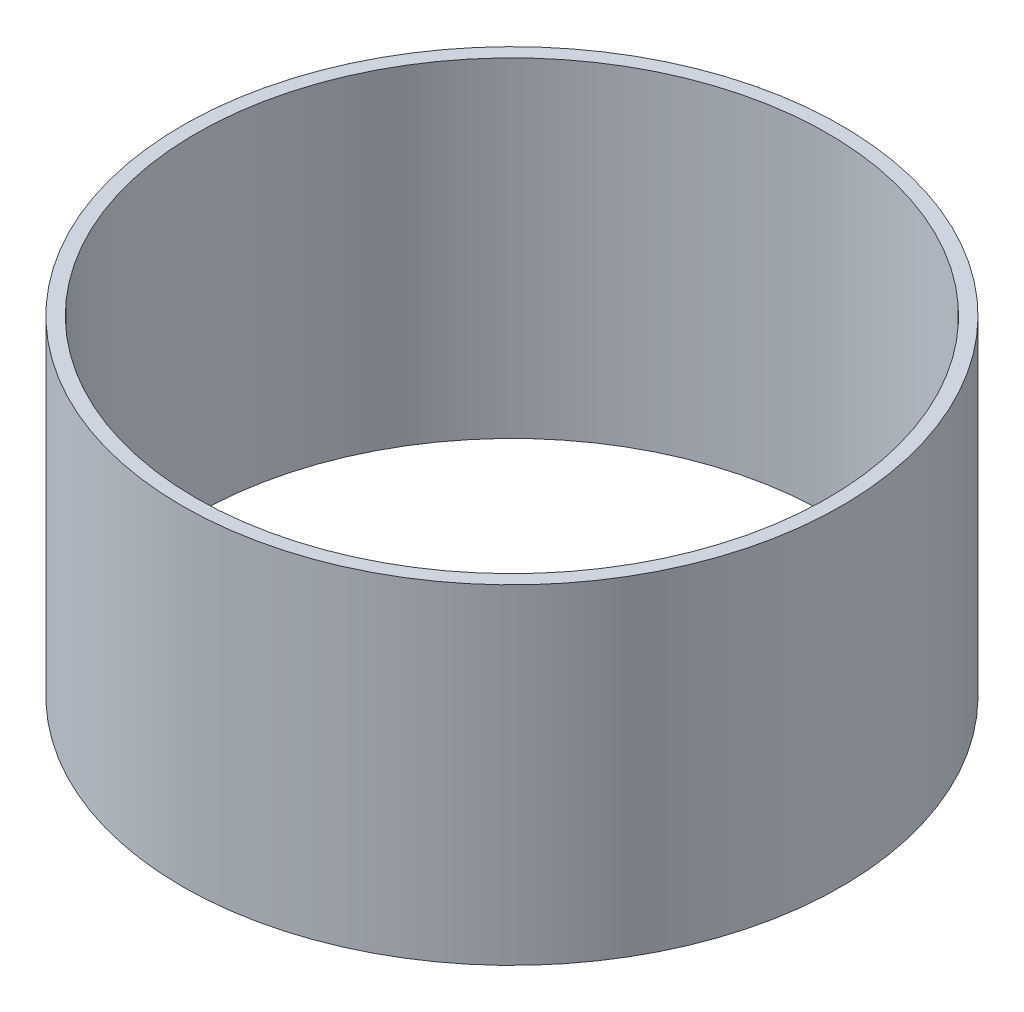
ISO-10303-21;
HEADER;
FILE_DESCRIPTION(('STEP AP214'),'2;1');
FILE_NAME('part.step','',(''),(''),'','','');
FILE_SCHEMA(('AUTOMOTIVE_DESIGN { 1 0 10303 214 1 1 1 1 }'));
ENDSEC;
DATA;
#1=APPLICATION_CONTEXT('core data for automotive mechanical design processes');
#2=APPLICATION_PROTOCOL_DEFINITION('international standard','automotive_design',2000,#1);
#3=PRODUCT_CONTEXT('',#1,'mechanical');
#4=PRODUCT('Part','Part','',(#3));
#5=PRODUCT_RELATED_PRODUCT_CATEGORY('part','',(#4));
#6=PRODUCT_DEFINITION_FORMATION('','',#4);
#7=PRODUCT_DEFINITION_CONTEXT('part definition',#1,'design');
#8=PRODUCT_DEFINITION('design','',#6,#7);
#9=PRODUCT_DEFINITION_SHAPE('','',#8);
#10=(LENGTH_UNIT() NAMED_UNIT(*) SI_UNIT(.MILLI.,.METRE.));
#11=(NAMED_UNIT(*) PLANE_ANGLE_UNIT() SI_UNIT($,.RADIAN.));
#12=(NAMED_UNIT(*) SI_UNIT($,.STERADIAN.) SOLID_ANGLE_UNIT());
#13=UNCERTAINTY_MEASURE_WITH_UNIT(LENGTH_MEASURE(1.E-05),#10,'distance_accuracy_value','');
#14=(GEOMETRIC_REPRESENTATION_CONTEXT(3) GLOBAL_UNCERTAINTY_ASSIGNED_CONTEXT((#13)) GLOBAL_UNIT_ASSIGNED_CONTEXT((#10,
#11,#12)) REPRESENTATION_CONTEXT('',''));
#15=CARTESIAN_POINT('',(0.,0.,0.));
#16=DIRECTION('',(0.,0.,1.));
#17=DIRECTION('',(1.,0.,0.));
#18=AXIS2_PLACEMENT_3D('',#15,#16,#17);
#19=CARTESIAN_POINT('',(0.,152.4,0.));
#20=DIRECTION('',(0.,1.,0.));
#21=DIRECTION('',(0.,0.,1.));
#22=AXIS2_PLACEMENT_3D('',#19,#20,#21);
#23=PLANE('',#22);
#24=CARTESIAN_POINT('',(0.,152.4,0.));
#25=DIRECTION('',(0.,1.,0.));
#26=DIRECTION('',(0.,0.,1.));
#27=AXIS2_PLACEMENT_3D('',#24,#25,#26);
#28=CIRCLE('',#27,152.4);
#29=CARTESIAN_POINT('',(0.,152.4,152.4));
#30=VERTEX_POINT('',#29);
#31=EDGE_CURVE('E10',#30,#30,#28,.T.);
#32=ORIENTED_EDGE('',*,*,#31,.T.);
#33=EDGE_LOOP('',(#32));
#34=FACE_BOUND('',#33,.T.);
#35=CARTESIAN_POINT('',(0.,152.4,0.));
#36=DIRECTION('',(0.,1.,0.));
#37=DIRECTION('',(0.,0.,1.));
#38=AXIS2_PLACEMENT_3D('',#35,#36,#37);
#39=CIRCLE('',#38,146.05);
#40=CARTESIAN_POINT('',(0.,152.4,146.05));
#41=VERTEX_POINT('',#40);
#42=EDGE_CURVE('E46',#41,#41,#39,.T.);
#43=ORIENTED_EDGE('',*,*,#42,.F.);
#44=EDGE_LOOP('',(#43));
#45=FACE_BOUND('',#44,.T.);
#46=ADVANCED_FACE('F35',(#34,#45),#23,.T.);
#47=CARTESIAN_POINT('',(0.,0.,0.));
#48=DIRECTION('',(0.,1.,0.));
#49=DIRECTION('',(0.,0.,1.));
#50=AXIS2_PLACEMENT_3D('',#47,#48,#49);
#51=PLANE('',#50);
#52=CARTESIAN_POINT('',(0.,0.,0.));
#53=DIRECTION('',(0.,1.,0.));
#54=DIRECTION('',(0.,0.,1.));
#55=AXIS2_PLACEMENT_3D('',#52,#53,#54);
#56=CIRCLE('',#55,152.4);
#57=CARTESIAN_POINT('',(0.,0.,152.4));
#58=VERTEX_POINT('',#57);
#59=EDGE_CURVE('E39',#58,#58,#56,.T.);
#60=ORIENTED_EDGE('',*,*,#59,.F.);
#61=EDGE_LOOP('',(#60));
#62=FACE_BOUND('',#61,.T.);
#63=CARTESIAN_POINT('',(0.,0.,0.));
#64=DIRECTION('',(0.,1.,0.));
#65=DIRECTION('',(0.,0.,1.));
#66=AXIS2_PLACEMENT_3D('',#63,#64,#65);
#67=CIRCLE('',#66,146.05);
#68=CARTESIAN_POINT('',(0.,0.,146.05));
#69=VERTEX_POINT('',#68);
#70=EDGE_CURVE('E48',#69,#69,#67,.T.);
#71=ORIENTED_EDGE('',*,*,#70,.T.);
#72=EDGE_LOOP('',(#71));
#73=FACE_BOUND('',#72,.T.);
#74=ADVANCED_FACE('F58',(#62,#73),#51,.F.);
#75=CARTESIAN_POINT('',(0.,152.4,0.));
#76=DIRECTION('',(0.,-1.,0.));
#77=DIRECTION('',(0.,0.,-1.));
#78=AXIS2_PLACEMENT_3D('',#75,#76,#77);
#79=CYLINDRICAL_SURFACE('',#78,152.4);
#80=ORIENTED_EDGE('',*,*,#31,.F.);
#81=EDGE_LOOP('',(#80));
#82=FACE_BOUND('',#81,.T.);
#83=ORIENTED_EDGE('',*,*,#59,.T.);
#84=EDGE_LOOP('',(#83));
#85=FACE_BOUND('',#84,.T.);
#86=ADVANCED_FACE('F37',(#82,#85),#79,.T.);
#87=CARTESIAN_POINT('',(0.,152.4,0.));
#88=DIRECTION('',(0.,-1.,0.));
#89=DIRECTION('',(0.,0.,-1.));
#90=AXIS2_PLACEMENT_3D('',#87,#88,#89);
#91=CYLINDRICAL_SURFACE('',#90,146.05);
#92=ORIENTED_EDGE('',*,*,#42,.T.);
#93=EDGE_LOOP('',(#92));
#94=FACE_BOUND('',#93,.T.);
#95=ORIENTED_EDGE('',*,*,#70,.F.);
#96=EDGE_LOOP('',(#95));
#97=FACE_BOUND('',#96,.T.);
#98=ADVANCED_FACE('F54',(#94,#97),#91,.F.);
#99=CLOSED_SHELL('',(#46,#74,#86,#98));
#100=MANIFOLD_SOLID_BREP('B2',#99);
#101=ADVANCED_BREP_SHAPE_REPRESENTATION('',(#18,#100),#14);
#102=SHAPE_DEFINITION_REPRESENTATION(#9,#101);
ENDSEC;
END-ISO-10303-21;
